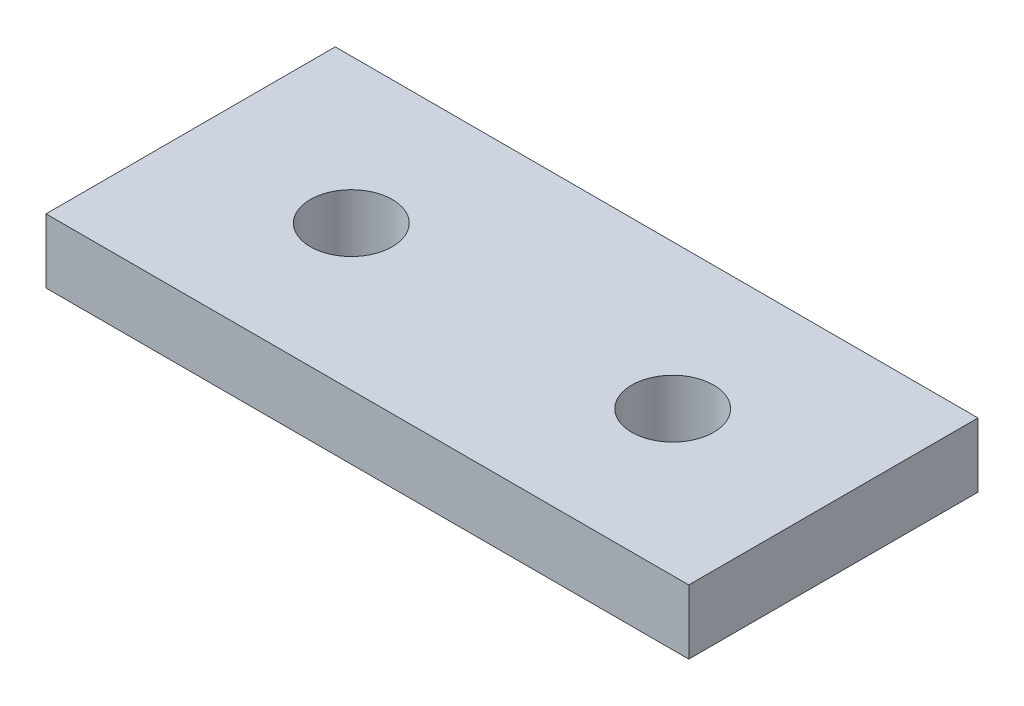
ISO-10303-21;
HEADER;
FILE_DESCRIPTION(('STEP AP214'),'2;1');
FILE_NAME('part.step','',(''),(''),'','','');
FILE_SCHEMA(('AUTOMOTIVE_DESIGN { 1 0 10303 214 1 1 1 1 }'));
ENDSEC;
DATA;
#1=APPLICATION_CONTEXT('core data for automotive mechanical design processes');
#2=APPLICATION_PROTOCOL_DEFINITION('international standard','automotive_design',2000,#1);
#3=PRODUCT_CONTEXT('',#1,'mechanical');
#4=PRODUCT('Part','Part','',(#3));
#5=PRODUCT_RELATED_PRODUCT_CATEGORY('part','',(#4));
#6=PRODUCT_DEFINITION_FORMATION('','',#4);
#7=PRODUCT_DEFINITION_CONTEXT('part definition',#1,'design');
#8=PRODUCT_DEFINITION('design','',#6,#7);
#9=PRODUCT_DEFINITION_SHAPE('','',#8);
#10=(LENGTH_UNIT() NAMED_UNIT(*) SI_UNIT(.MILLI.,.METRE.));
#11=(NAMED_UNIT(*) PLANE_ANGLE_UNIT() SI_UNIT($,.RADIAN.));
#12=(NAMED_UNIT(*) SI_UNIT($,.STERADIAN.) SOLID_ANGLE_UNIT());
#13=UNCERTAINTY_MEASURE_WITH_UNIT(LENGTH_MEASURE(1.E-05),#10,'distance_accuracy_value','');
#14=(GEOMETRIC_REPRESENTATION_CONTEXT(3) GLOBAL_UNCERTAINTY_ASSIGNED_CONTEXT((#13)) GLOBAL_UNIT_ASSIGNED_CONTEXT((#10,
#11,#12)) REPRESENTATION_CONTEXT('',''));
#15=CARTESIAN_POINT('',(0.,0.,0.));
#16=DIRECTION('',(0.,0.,1.));
#17=DIRECTION('',(1.,0.,0.));
#18=AXIS2_PLACEMENT_3D('',#15,#16,#17);
#19=CARTESIAN_POINT('',(0.,4.,0.));
#20=DIRECTION('',(0.,1.,0.));
#21=DIRECTION('',(0.,0.,1.));
#22=AXIS2_PLACEMENT_3D('',#19,#20,#21);
#23=PLANE('',#22);
#24=CARTESIAN_POINT('',(-10.,4.,0.));
#25=DIRECTION('',(0.,1.,0.));
#26=DIRECTION('',(0.,0.,1.));
#27=AXIS2_PLACEMENT_3D('',#24,#25,#26);
#28=CIRCLE('',#27,2.55);
#29=CARTESIAN_POINT('',(-10.,4.,2.55));
#30=VERTEX_POINT('',#29);
#31=EDGE_CURVE('E101',#30,#30,#28,.T.);
#32=ORIENTED_EDGE('',*,*,#31,.F.);
#33=EDGE_LOOP('',(#32));
#34=FACE_BOUND('',#33,.T.);
#35=DIRECTION('',(0.,0.,1.));
#36=VECTOR('',#35,1.);
#37=CARTESIAN_POINT('',(-20.,4.,9.));
#38=LINE('',#37,#36);
#39=CARTESIAN_POINT('',(-20.,4.,-9.));
#40=VERTEX_POINT('',#39);
#41=CARTESIAN_POINT('',(-20.,4.,9.));
#42=VERTEX_POINT('',#41);
#43=EDGE_CURVE('E86',#40,#42,#38,.T.);
#44=ORIENTED_EDGE('',*,*,#43,.T.);
#45=DIRECTION('',(1.,0.,0.));
#46=VECTOR('',#45,1.);
#47=CARTESIAN_POINT('',(20.,4.,8.99999999999999));
#48=LINE('',#47,#46);
#49=CARTESIAN_POINT('',(20.,4.,8.99999999999999));
#50=VERTEX_POINT('',#49);
#51=EDGE_CURVE('E81',#42,#50,#48,.T.);
#52=ORIENTED_EDGE('',*,*,#51,.T.);
#53=DIRECTION('',(0.,0.,-1.));
#54=VECTOR('',#53,1.);
#55=CARTESIAN_POINT('',(20.,4.,8.99999999999999));
#56=LINE('',#55,#54);
#57=CARTESIAN_POINT('',(20.,4.,-9.00000000000001));
#58=VERTEX_POINT('',#57);
#59=EDGE_CURVE('E84',#50,#58,#56,.T.);
#60=ORIENTED_EDGE('',*,*,#59,.T.);
#61=DIRECTION('',(-1.,0.,0.));
#62=VECTOR('',#61,1.);
#63=CARTESIAN_POINT('',(20.,4.,-9.00000000000001));
#64=LINE('',#63,#62);
#65=EDGE_CURVE('E51',#58,#40,#64,.T.);
#66=ORIENTED_EDGE('',*,*,#65,.T.);
#67=EDGE_LOOP('',(#44,#52,#60,#66));
#68=FACE_BOUND('',#67,.T.);
#69=CARTESIAN_POINT('',(9.99999999999999,4.,0.));
#70=DIRECTION('',(0.,1.,0.));
#71=DIRECTION('',(0.,0.,-1.));
#72=AXIS2_PLACEMENT_3D('',#69,#70,#71);
#73=CIRCLE('',#72,2.55);
#74=CARTESIAN_POINT('',(9.99999999999999,4.,-2.55));
#75=VERTEX_POINT('',#74);
#76=EDGE_CURVE('E116',#75,#75,#73,.T.);
#77=ORIENTED_EDGE('',*,*,#76,.F.);
#78=EDGE_LOOP('',(#77));
#79=FACE_BOUND('',#78,.T.);
#80=ADVANCED_FACE('F34',(#34,#68,#79),#23,.T.);
#81=CARTESIAN_POINT('',(0.,0.,0.));
#82=DIRECTION('',(0.,1.,0.));
#83=DIRECTION('',(0.,0.,1.));
#84=AXIS2_PLACEMENT_3D('',#81,#82,#83);
#85=PLANE('',#84);
#86=CARTESIAN_POINT('',(-10.,0.,0.));
#87=DIRECTION('',(0.,1.,0.));
#88=DIRECTION('',(0.,0.,1.));
#89=AXIS2_PLACEMENT_3D('',#86,#87,#88);
#90=CIRCLE('',#89,2.55);
#91=CARTESIAN_POINT('',(-10.,0.,2.55));
#92=VERTEX_POINT('',#91);
#93=EDGE_CURVE('E113',#92,#92,#90,.T.);
#94=ORIENTED_EDGE('',*,*,#93,.T.);
#95=EDGE_LOOP('',(#94));
#96=FACE_BOUND('',#95,.T.);
#97=DIRECTION('',(0.,0.,1.));
#98=VECTOR('',#97,1.);
#99=CARTESIAN_POINT('',(-20.,0.,9.));
#100=LINE('',#99,#98);
#101=CARTESIAN_POINT('',(-20.,0.,-9.));
#102=VERTEX_POINT('',#101);
#103=CARTESIAN_POINT('',(-20.,0.,9.));
#104=VERTEX_POINT('',#103);
#105=EDGE_CURVE('E98',#102,#104,#100,.T.);
#106=ORIENTED_EDGE('',*,*,#105,.F.);
#107=DIRECTION('',(-1.,0.,0.));
#108=VECTOR('',#107,1.);
#109=CARTESIAN_POINT('',(20.,0.,-9.00000000000001));
#110=LINE('',#109,#108);
#111=CARTESIAN_POINT('',(20.,0.,-9.00000000000001));
#112=VERTEX_POINT('',#111);
#113=EDGE_CURVE('E74',#112,#102,#110,.T.);
#114=ORIENTED_EDGE('',*,*,#113,.F.);
#115=DIRECTION('',(0.,0.,-1.));
#116=VECTOR('',#115,1.);
#117=CARTESIAN_POINT('',(20.,0.,8.99999999999999));
#118=LINE('',#117,#116);
#119=CARTESIAN_POINT('',(20.,0.,8.99999999999999));
#120=VERTEX_POINT('',#119);
#121=EDGE_CURVE('E68',#120,#112,#118,.T.);
#122=ORIENTED_EDGE('',*,*,#121,.F.);
#123=DIRECTION('',(1.,0.,0.));
#124=VECTOR('',#123,1.);
#125=CARTESIAN_POINT('',(20.,0.,8.99999999999999));
#126=LINE('',#125,#124);
#127=EDGE_CURVE('E90',#104,#120,#126,.T.);
#128=ORIENTED_EDGE('',*,*,#127,.F.);
#129=EDGE_LOOP('',(#106,#114,#122,#128));
#130=FACE_BOUND('',#129,.T.);
#131=CARTESIAN_POINT('',(9.99999999999999,0.,0.));
#132=DIRECTION('',(0.,1.,0.));
#133=DIRECTION('',(0.,0.,-1.));
#134=AXIS2_PLACEMENT_3D('',#131,#132,#133);
#135=CIRCLE('',#134,2.55);
#136=CARTESIAN_POINT('',(9.99999999999999,0.,-2.55));
#137=VERTEX_POINT('',#136);
#138=EDGE_CURVE('E119',#137,#137,#135,.T.);
#139=ORIENTED_EDGE('',*,*,#138,.T.);
#140=EDGE_LOOP('',(#139));
#141=FACE_BOUND('',#140,.T.);
#142=ADVANCED_FACE('F109',(#96,#130,#141),#85,.F.);
#143=CARTESIAN_POINT('',(-20.,4.,9.));
#144=DIRECTION('',(1.,0.,0.));
#145=DIRECTION('',(0.,0.,-1.));
#146=AXIS2_PLACEMENT_3D('',#143,#144,#145);
#147=PLANE('',#146);
#148=ORIENTED_EDGE('',*,*,#105,.T.);
#149=DIRECTION('',(0.,-1.,0.));
#150=VECTOR('',#149,1.);
#151=CARTESIAN_POINT('',(-20.,4.,9.));
#152=LINE('',#151,#150);
#153=EDGE_CURVE('E11',#42,#104,#152,.T.);
#154=ORIENTED_EDGE('',*,*,#153,.F.);
#155=ORIENTED_EDGE('',*,*,#43,.F.);
#156=DIRECTION('',(0.,-1.,0.));
#157=VECTOR('',#156,1.);
#158=CARTESIAN_POINT('',(-20.,4.,-9.));
#159=LINE('',#158,#157);
#160=EDGE_CURVE('E94',#40,#102,#159,.T.);
#161=ORIENTED_EDGE('',*,*,#160,.T.);
#162=EDGE_LOOP('',(#148,#154,#155,#161));
#163=FACE_BOUND('',#162,.T.);
#164=ADVANCED_FACE('F36',(#163),#147,.F.);
#165=CARTESIAN_POINT('',(20.,4.,8.99999999999999));
#166=DIRECTION('',(0.,0.,-1.));
#167=DIRECTION('',(-1.,0.,0.));
#168=AXIS2_PLACEMENT_3D('',#165,#166,#167);
#169=PLANE('',#168);
#170=ORIENTED_EDGE('',*,*,#127,.T.);
#171=DIRECTION('',(0.,-1.,0.));
#172=VECTOR('',#171,1.);
#173=CARTESIAN_POINT('',(20.,4.,8.99999999999999));
#174=LINE('',#173,#172);
#175=EDGE_CURVE('E43',#50,#120,#174,.T.);
#176=ORIENTED_EDGE('',*,*,#175,.F.);
#177=ORIENTED_EDGE('',*,*,#51,.F.);
#178=ORIENTED_EDGE('',*,*,#153,.T.);
#179=EDGE_LOOP('',(#170,#176,#177,#178));
#180=FACE_BOUND('',#179,.T.);
#181=ADVANCED_FACE('F89',(#180),#169,.F.);
#182=CARTESIAN_POINT('',(20.,4.,8.99999999999999));
#183=DIRECTION('',(-1.,0.,0.));
#184=DIRECTION('',(0.,0.,1.));
#185=AXIS2_PLACEMENT_3D('',#182,#183,#184);
#186=PLANE('',#185);
#187=ORIENTED_EDGE('',*,*,#121,.T.);
#188=DIRECTION('',(0.,-1.,0.));
#189=VECTOR('',#188,1.);
#190=CARTESIAN_POINT('',(20.,4.,-9.00000000000001));
#191=LINE('',#190,#189);
#192=EDGE_CURVE('E91',#58,#112,#191,.T.);
#193=ORIENTED_EDGE('',*,*,#192,.F.);
#194=ORIENTED_EDGE('',*,*,#59,.F.);
#195=ORIENTED_EDGE('',*,*,#175,.T.);
#196=EDGE_LOOP('',(#187,#193,#194,#195));
#197=FACE_BOUND('',#196,.T.);
#198=ADVANCED_FACE('F92',(#197),#186,.F.);
#199=CARTESIAN_POINT('',(20.,4.,-9.00000000000001));
#200=DIRECTION('',(0.,0.,1.));
#201=DIRECTION('',(1.,0.,0.));
#202=AXIS2_PLACEMENT_3D('',#199,#200,#201);
#203=PLANE('',#202);
#204=ORIENTED_EDGE('',*,*,#113,.T.);
#205=ORIENTED_EDGE('',*,*,#160,.F.);
#206=ORIENTED_EDGE('',*,*,#65,.F.);
#207=ORIENTED_EDGE('',*,*,#192,.T.);
#208=EDGE_LOOP('',(#204,#205,#206,#207));
#209=FACE_BOUND('',#208,.T.);
#210=ADVANCED_FACE('F106',(#209),#203,.F.);
#211=CARTESIAN_POINT('',(-10.,4.,0.));
#212=DIRECTION('',(0.,-1.,0.));
#213=DIRECTION('',(0.,0.,-1.));
#214=AXIS2_PLACEMENT_3D('',#211,#212,#213);
#215=CYLINDRICAL_SURFACE('',#214,2.55);
#216=ORIENTED_EDGE('',*,*,#31,.T.);
#217=EDGE_LOOP('',(#216));
#218=FACE_BOUND('',#217,.T.);
#219=ORIENTED_EDGE('',*,*,#93,.F.);
#220=EDGE_LOOP('',(#219));
#221=FACE_BOUND('',#220,.T.);
#222=ADVANCED_FACE('F137',(#218,#221),#215,.F.);
#223=CARTESIAN_POINT('',(9.99999999999999,4.,0.));
#224=DIRECTION('',(0.,-1.,0.));
#225=DIRECTION('',(0.,0.,-1.));
#226=AXIS2_PLACEMENT_3D('',#223,#224,#225);
#227=CYLINDRICAL_SURFACE('',#226,2.55);
#228=ORIENTED_EDGE('',*,*,#76,.T.);
#229=EDGE_LOOP('',(#228));
#230=FACE_BOUND('',#229,.T.);
#231=ORIENTED_EDGE('',*,*,#138,.F.);
#232=EDGE_LOOP('',(#231));
#233=FACE_BOUND('',#232,.T.);
#234=ADVANCED_FACE('F125',(#230,#233),#227,.F.);
#235=CLOSED_SHELL('',(#80,#142,#164,#181,#198,#210,#222,#234));
#236=MANIFOLD_SOLID_BREP('B2',#235);
#237=ADVANCED_BREP_SHAPE_REPRESENTATION('',(#18,#236),#14);
#238=SHAPE_DEFINITION_REPRESENTATION(#9,#237);
ENDSEC;
END-ISO-10303-21;
